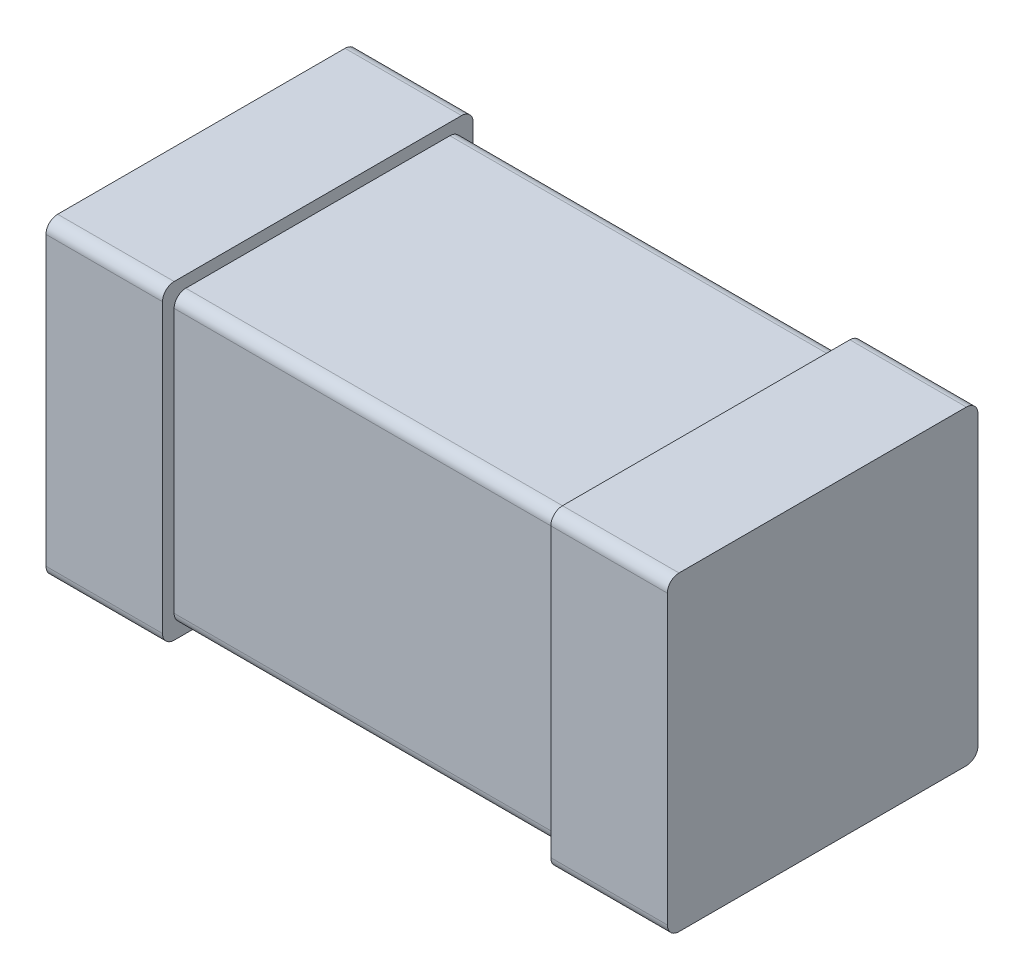
ISO-10303-21;
HEADER;
FILE_DESCRIPTION(('STEP AP214'),'2;1');
FILE_NAME('part.step','',(''),(''),'','','');
FILE_SCHEMA(('AUTOMOTIVE_DESIGN { 1 0 10303 214 1 1 1 1 }'));
ENDSEC;
DATA;
#1=APPLICATION_CONTEXT('core data for automotive mechanical design processes');
#2=APPLICATION_PROTOCOL_DEFINITION('international standard','automotive_design',2000,#1);
#3=PRODUCT_CONTEXT('',#1,'mechanical');
#4=PRODUCT('Part','Part','',(#3));
#5=PRODUCT_RELATED_PRODUCT_CATEGORY('part','',(#4));
#6=PRODUCT_DEFINITION_FORMATION('','',#4);
#7=PRODUCT_DEFINITION_CONTEXT('part definition',#1,'design');
#8=PRODUCT_DEFINITION('design','',#6,#7);
#9=PRODUCT_DEFINITION_SHAPE('','',#8);
#10=(LENGTH_UNIT() NAMED_UNIT(*) SI_UNIT(.MILLI.,.METRE.));
#11=(NAMED_UNIT(*) PLANE_ANGLE_UNIT() SI_UNIT($,.RADIAN.));
#12=(NAMED_UNIT(*) SI_UNIT($,.STERADIAN.) SOLID_ANGLE_UNIT());
#13=UNCERTAINTY_MEASURE_WITH_UNIT(LENGTH_MEASURE(1.E-05),#10,'distance_accuracy_value','');
#14=(GEOMETRIC_REPRESENTATION_CONTEXT(3) GLOBAL_UNCERTAINTY_ASSIGNED_CONTEXT((#13)) GLOBAL_UNIT_ASSIGNED_CONTEXT((#10,
#11,#12)) REPRESENTATION_CONTEXT('',''));
#15=CARTESIAN_POINT('',(0.,0.,0.));
#16=DIRECTION('',(0.,0.,1.));
#17=DIRECTION('',(1.,0.,0.));
#18=AXIS2_PLACEMENT_3D('',#15,#16,#17);
#19=CARTESIAN_POINT('',(-0.8,-0.4,0.));
#20=DIRECTION('',(1.,0.,0.));
#21=DIRECTION('',(0.,0.,1.));
#22=AXIS2_PLACEMENT_3D('',#19,#20,#21);
#23=PLANE('',#22);
#24=CARTESIAN_POINT('',(-0.8,-0.37,0.77));
#25=DIRECTION('',(-1.,0.,0.));
#26=DIRECTION('',(0.,0.,1.));
#27=AXIS2_PLACEMENT_3D('',#24,#25,#26);
#28=CIRCLE('',#27,0.03);
#29=CARTESIAN_POINT('',(-0.8,-0.4,0.77));
#30=VERTEX_POINT('',#29);
#31=CARTESIAN_POINT('',(-0.8,-0.37,0.8));
#32=VERTEX_POINT('',#31);
#33=EDGE_CURVE('E11',#30,#32,#28,.T.);
#34=ORIENTED_EDGE('',*,*,#33,.T.);
#35=DIRECTION('',(0.,1.,0.));
#36=VECTOR('',#35,1.);
#37=CARTESIAN_POINT('',(-0.8,-0.4,0.8));
#38=LINE('',#37,#36);
#39=CARTESIAN_POINT('',(-0.8,0.37,0.8));
#40=VERTEX_POINT('',#39);
#41=EDGE_CURVE('E25',#32,#40,#38,.T.);
#42=ORIENTED_EDGE('',*,*,#41,.T.);
#43=CARTESIAN_POINT('',(-0.8,0.37,0.77));
#44=DIRECTION('',(1.,0.,0.));
#45=DIRECTION('',(0.,0.,1.));
#46=AXIS2_PLACEMENT_3D('',#43,#44,#45);
#47=CIRCLE('',#46,0.03);
#48=CARTESIAN_POINT('',(-0.8,0.4,0.77));
#49=VERTEX_POINT('',#48);
#50=EDGE_CURVE('E450',#49,#40,#47,.T.);
#51=ORIENTED_EDGE('',*,*,#50,.F.);
#52=DIRECTION('',(0.,0.,1.));
#53=VECTOR('',#52,1.);
#54=CARTESIAN_POINT('',(-0.8,0.4,0.));
#55=LINE('',#54,#53);
#56=CARTESIAN_POINT('',(-0.8,0.4,0.03));
#57=VERTEX_POINT('',#56);
#58=EDGE_CURVE('E445',#57,#49,#55,.T.);
#59=ORIENTED_EDGE('',*,*,#58,.F.);
#60=CARTESIAN_POINT('',(-0.8,0.37,0.03));
#61=DIRECTION('',(-1.,0.,0.));
#62=DIRECTION('',(0.,0.,1.));
#63=AXIS2_PLACEMENT_3D('',#60,#61,#62);
#64=CIRCLE('',#63,0.03);
#65=CARTESIAN_POINT('',(-0.8,0.37,0.));
#66=VERTEX_POINT('',#65);
#67=EDGE_CURVE('E441',#57,#66,#64,.T.);
#68=ORIENTED_EDGE('',*,*,#67,.T.);
#69=DIRECTION('',(0.,1.,0.));
#70=VECTOR('',#69,1.);
#71=CARTESIAN_POINT('',(-0.8,-0.4,0.));
#72=LINE('',#71,#70);
#73=CARTESIAN_POINT('',(-0.8,-0.37,0.));
#74=VERTEX_POINT('',#73);
#75=EDGE_CURVE('E436',#74,#66,#72,.T.);
#76=ORIENTED_EDGE('',*,*,#75,.F.);
#77=CARTESIAN_POINT('',(-0.8,-0.37,0.03));
#78=DIRECTION('',(1.,0.,0.));
#79=DIRECTION('',(0.,0.,1.));
#80=AXIS2_PLACEMENT_3D('',#77,#78,#79);
#81=CIRCLE('',#80,0.03);
#82=CARTESIAN_POINT('',(-0.8,-0.4,0.03));
#83=VERTEX_POINT('',#82);
#84=EDGE_CURVE('E431',#83,#74,#81,.T.);
#85=ORIENTED_EDGE('',*,*,#84,.F.);
#86=DIRECTION('',(0.,0.,1.));
#87=VECTOR('',#86,1.);
#88=CARTESIAN_POINT('',(-0.8,-0.4,0.));
#89=LINE('',#88,#87);
#90=EDGE_CURVE('E427',#83,#30,#89,.T.);
#91=ORIENTED_EDGE('',*,*,#90,.T.);
#92=EDGE_LOOP('',(#34,#42,#51,#59,#68,#76,#85,#91));
#93=FACE_BOUND('',#92,.T.);
#94=ADVANCED_FACE('F17',(#93),#23,.F.);
#95=CARTESIAN_POINT('',(-0.8,-0.4,0.));
#96=DIRECTION('',(0.,1.,0.));
#97=DIRECTION('',(0.,0.,1.));
#98=AXIS2_PLACEMENT_3D('',#95,#96,#97);
#99=PLANE('',#98);
#100=DIRECTION('',(1.,0.,0.));
#101=VECTOR('',#100,1.);
#102=CARTESIAN_POINT('',(-0.8,-0.4,0.77));
#103=LINE('',#102,#101);
#104=CARTESIAN_POINT('',(-0.5,-0.4,0.77));
#105=VERTEX_POINT('',#104);
#106=EDGE_CURVE('E422',#30,#105,#103,.T.);
#107=ORIENTED_EDGE('',*,*,#106,.F.);
#108=ORIENTED_EDGE('',*,*,#90,.F.);
#109=DIRECTION('',(1.,0.,0.));
#110=VECTOR('',#109,1.);
#111=CARTESIAN_POINT('',(-0.8,-0.4,0.03));
#112=LINE('',#111,#110);
#113=CARTESIAN_POINT('',(-0.5,-0.4,0.03));
#114=VERTEX_POINT('',#113);
#115=EDGE_CURVE('E418',#83,#114,#112,.T.);
#116=ORIENTED_EDGE('',*,*,#115,.T.);
#117=DIRECTION('',(0.,0.,1.));
#118=VECTOR('',#117,1.);
#119=CARTESIAN_POINT('',(-0.5,-0.4,0.));
#120=LINE('',#119,#118);
#121=EDGE_CURVE('E414',#114,#105,#120,.T.);
#122=ORIENTED_EDGE('',*,*,#121,.T.);
#123=EDGE_LOOP('',(#107,#108,#116,#122));
#124=FACE_BOUND('',#123,.T.);
#125=ADVANCED_FACE('F495',(#124),#99,.F.);
#126=CARTESIAN_POINT('',(-0.5,-0.4,0.));
#127=DIRECTION('',(1.,0.,0.));
#128=DIRECTION('',(0.,0.,1.));
#129=AXIS2_PLACEMENT_3D('',#126,#127,#128);
#130=PLANE('',#129);
#131=ORIENTED_EDGE('',*,*,#121,.F.);
#132=CARTESIAN_POINT('',(-0.5,-0.37,0.03));
#133=DIRECTION('',(1.,0.,0.));
#134=DIRECTION('',(0.,0.,1.));
#135=AXIS2_PLACEMENT_3D('',#132,#133,#134);
#136=CIRCLE('',#135,0.03);
#137=CARTESIAN_POINT('',(-0.5,-0.37,0.));
#138=VERTEX_POINT('',#137);
#139=EDGE_CURVE('E410',#114,#138,#136,.T.);
#140=ORIENTED_EDGE('',*,*,#139,.T.);
#141=DIRECTION('',(0.,1.,0.));
#142=VECTOR('',#141,1.);
#143=CARTESIAN_POINT('',(-0.5,-0.4,0.));
#144=LINE('',#143,#142);
#145=CARTESIAN_POINT('',(-0.5,0.37,0.));
#146=VERTEX_POINT('',#145);
#147=EDGE_CURVE('E406',#138,#146,#144,.T.);
#148=ORIENTED_EDGE('',*,*,#147,.T.);
#149=CARTESIAN_POINT('',(-0.5,0.37,0.03));
#150=DIRECTION('',(-1.,0.,0.));
#151=DIRECTION('',(0.,0.,1.));
#152=AXIS2_PLACEMENT_3D('',#149,#150,#151);
#153=CIRCLE('',#152,0.03);
#154=CARTESIAN_POINT('',(-0.5,0.4,0.03));
#155=VERTEX_POINT('',#154);
#156=EDGE_CURVE('E401',#155,#146,#153,.T.);
#157=ORIENTED_EDGE('',*,*,#156,.F.);
#158=DIRECTION('',(0.,0.,1.));
#159=VECTOR('',#158,1.);
#160=CARTESIAN_POINT('',(-0.5,0.4,0.));
#161=LINE('',#160,#159);
#162=CARTESIAN_POINT('',(-0.5,0.4,0.77));
#163=VERTEX_POINT('',#162);
#164=EDGE_CURVE('E397',#155,#163,#161,.T.);
#165=ORIENTED_EDGE('',*,*,#164,.T.);
#166=CARTESIAN_POINT('',(-0.5,0.37,0.77));
#167=DIRECTION('',(1.,0.,0.));
#168=DIRECTION('',(0.,0.,1.));
#169=AXIS2_PLACEMENT_3D('',#166,#167,#168);
#170=CIRCLE('',#169,0.03);
#171=CARTESIAN_POINT('',(-0.5,0.37,0.8));
#172=VERTEX_POINT('',#171);
#173=EDGE_CURVE('E393',#163,#172,#170,.T.);
#174=ORIENTED_EDGE('',*,*,#173,.T.);
#175=DIRECTION('',(0.,1.,0.));
#176=VECTOR('',#175,1.);
#177=CARTESIAN_POINT('',(-0.5,-0.4,0.8));
#178=LINE('',#177,#176);
#179=CARTESIAN_POINT('',(-0.5,-0.37,0.8));
#180=VERTEX_POINT('',#179);
#181=EDGE_CURVE('E388',#180,#172,#178,.T.);
#182=ORIENTED_EDGE('',*,*,#181,.F.);
#183=CARTESIAN_POINT('',(-0.5,-0.37,0.77));
#184=DIRECTION('',(-1.,0.,0.));
#185=DIRECTION('',(0.,0.,1.));
#186=AXIS2_PLACEMENT_3D('',#183,#184,#185);
#187=CIRCLE('',#186,0.03);
#188=EDGE_CURVE('E383',#105,#180,#187,.T.);
#189=ORIENTED_EDGE('',*,*,#188,.F.);
#190=EDGE_LOOP('',(#131,#140,#148,#157,#165,#174,#182,#189));
#191=FACE_BOUND('',#190,.T.);
#192=CARTESIAN_POINT('',(-0.5,-0.34,0.06));
#193=DIRECTION('',(1.,0.,0.));
#194=DIRECTION('',(0.,0.,1.));
#195=AXIS2_PLACEMENT_3D('',#192,#193,#194);
#196=CIRCLE('',#195,0.03);
#197=CARTESIAN_POINT('',(-0.5,-0.37,0.06));
#198=VERTEX_POINT('',#197);
#199=CARTESIAN_POINT('',(-0.5,-0.34,0.03));
#200=VERTEX_POINT('',#199);
#201=EDGE_CURVE('E378',#198,#200,#196,.T.);
#202=ORIENTED_EDGE('',*,*,#201,.F.);
#203=DIRECTION('',(0.,0.,1.));
#204=VECTOR('',#203,1.);
#205=CARTESIAN_POINT('',(-0.5,-0.37,0.03));
#206=LINE('',#205,#204);
#207=CARTESIAN_POINT('',(-0.5,-0.37,0.74));
#208=VERTEX_POINT('',#207);
#209=EDGE_CURVE('E374',#198,#208,#206,.T.);
#210=ORIENTED_EDGE('',*,*,#209,.T.);
#211=CARTESIAN_POINT('',(-0.5,-0.34,0.74));
#212=DIRECTION('',(-1.,0.,0.));
#213=DIRECTION('',(0.,0.,1.));
#214=AXIS2_PLACEMENT_3D('',#211,#212,#213);
#215=CIRCLE('',#214,0.03);
#216=CARTESIAN_POINT('',(-0.5,-0.34,0.77));
#217=VERTEX_POINT('',#216);
#218=EDGE_CURVE('E370',#208,#217,#215,.T.);
#219=ORIENTED_EDGE('',*,*,#218,.T.);
#220=DIRECTION('',(0.,1.,0.));
#221=VECTOR('',#220,1.);
#222=CARTESIAN_POINT('',(-0.5,-0.37,0.77));
#223=LINE('',#222,#221);
#224=CARTESIAN_POINT('',(-0.5,0.34,0.77));
#225=VERTEX_POINT('',#224);
#226=EDGE_CURVE('E366',#217,#225,#223,.T.);
#227=ORIENTED_EDGE('',*,*,#226,.T.);
#228=CARTESIAN_POINT('',(-0.5,0.34,0.74));
#229=DIRECTION('',(1.,0.,0.));
#230=DIRECTION('',(0.,0.,1.));
#231=AXIS2_PLACEMENT_3D('',#228,#229,#230);
#232=CIRCLE('',#231,0.03);
#233=CARTESIAN_POINT('',(-0.5,0.37,0.74));
#234=VERTEX_POINT('',#233);
#235=EDGE_CURVE('E361',#234,#225,#232,.T.);
#236=ORIENTED_EDGE('',*,*,#235,.F.);
#237=DIRECTION('',(0.,0.,1.));
#238=VECTOR('',#237,1.);
#239=CARTESIAN_POINT('',(-0.5,0.37,0.03));
#240=LINE('',#239,#238);
#241=CARTESIAN_POINT('',(-0.5,0.37,0.06));
#242=VERTEX_POINT('',#241);
#243=EDGE_CURVE('E356',#242,#234,#240,.T.);
#244=ORIENTED_EDGE('',*,*,#243,.F.);
#245=CARTESIAN_POINT('',(-0.5,0.34,0.06));
#246=DIRECTION('',(-1.,0.,0.));
#247=DIRECTION('',(0.,0.,1.));
#248=AXIS2_PLACEMENT_3D('',#245,#246,#247);
#249=CIRCLE('',#248,0.03);
#250=CARTESIAN_POINT('',(-0.5,0.34,0.03));
#251=VERTEX_POINT('',#250);
#252=EDGE_CURVE('E352',#242,#251,#249,.T.);
#253=ORIENTED_EDGE('',*,*,#252,.T.);
#254=DIRECTION('',(0.,1.,0.));
#255=VECTOR('',#254,1.);
#256=CARTESIAN_POINT('',(-0.5,-0.37,0.03));
#257=LINE('',#256,#255);
#258=EDGE_CURVE('E347',#200,#251,#257,.T.);
#259=ORIENTED_EDGE('',*,*,#258,.F.);
#260=EDGE_LOOP('',(#202,#210,#219,#227,#236,#244,#253,#259));
#261=FACE_BOUND('',#260,.T.);
#262=ADVANCED_FACE('F573',(#191,#261),#130,.T.);
#263=CARTESIAN_POINT('',(-0.5,-0.37,0.03));
#264=DIRECTION('',(0.,0.,1.));
#265=DIRECTION('',(1.,0.,0.));
#266=AXIS2_PLACEMENT_3D('',#263,#264,#265);
#267=PLANE('',#266);
#268=DIRECTION('',(1.,0.,0.));
#269=VECTOR('',#268,1.);
#270=CARTESIAN_POINT('',(-0.5,0.34,0.03));
#271=LINE('',#270,#269);
#272=CARTESIAN_POINT('',(0.5,0.34,0.03));
#273=VERTEX_POINT('',#272);
#274=EDGE_CURVE('E343',#251,#273,#271,.T.);
#275=ORIENTED_EDGE('',*,*,#274,.T.);
#276=DIRECTION('',(0.,1.,0.));
#277=VECTOR('',#276,1.);
#278=CARTESIAN_POINT('',(0.5,-0.37,0.03));
#279=LINE('',#278,#277);
#280=CARTESIAN_POINT('',(0.5,-0.34,0.03));
#281=VERTEX_POINT('',#280);
#282=EDGE_CURVE('E338',#281,#273,#279,.T.);
#283=ORIENTED_EDGE('',*,*,#282,.F.);
#284=DIRECTION('',(1.,0.,0.));
#285=VECTOR('',#284,1.);
#286=CARTESIAN_POINT('',(-0.5,-0.34,0.03));
#287=LINE('',#286,#285);
#288=EDGE_CURVE('E333',#200,#281,#287,.T.);
#289=ORIENTED_EDGE('',*,*,#288,.F.);
#290=ORIENTED_EDGE('',*,*,#258,.T.);
#291=EDGE_LOOP('',(#275,#283,#289,#290));
#292=FACE_BOUND('',#291,.T.);
#293=ADVANCED_FACE('F577',(#292),#267,.F.);
#294=CARTESIAN_POINT('',(-0.5,-0.34,0.06));
#295=DIRECTION('',(1.,0.,0.));
#296=DIRECTION('',(0.,0.707106781186547,0.707106781186548));
#297=AXIS2_PLACEMENT_3D('',#294,#295,#296);
#298=CYLINDRICAL_SURFACE('',#297,0.03);
#299=ORIENTED_EDGE('',*,*,#201,.T.);
#300=ORIENTED_EDGE('',*,*,#288,.T.);
#301=CARTESIAN_POINT('',(0.5,-0.34,0.06));
#302=DIRECTION('',(1.,0.,0.));
#303=DIRECTION('',(0.,0.,1.));
#304=AXIS2_PLACEMENT_3D('',#301,#302,#303);
#305=CIRCLE('',#304,0.03);
#306=CARTESIAN_POINT('',(0.5,-0.37,0.06));
#307=VERTEX_POINT('',#306);
#308=EDGE_CURVE('E328',#307,#281,#305,.T.);
#309=ORIENTED_EDGE('',*,*,#308,.F.);
#310=DIRECTION('',(1.,0.,0.));
#311=VECTOR('',#310,1.);
#312=CARTESIAN_POINT('',(-0.5,-0.37,0.06));
#313=LINE('',#312,#311);
#314=EDGE_CURVE('E323',#198,#307,#313,.T.);
#315=ORIENTED_EDGE('',*,*,#314,.F.);
#316=EDGE_LOOP('',(#299,#300,#309,#315));
#317=FACE_BOUND('',#316,.T.);
#318=ADVANCED_FACE('F583',(#317),#298,.T.);
#319=CARTESIAN_POINT('',(-0.5,-0.37,0.03));
#320=DIRECTION('',(0.,1.,0.));
#321=DIRECTION('',(0.,0.,1.));
#322=AXIS2_PLACEMENT_3D('',#319,#320,#321);
#323=PLANE('',#322);
#324=DIRECTION('',(1.,0.,0.));
#325=VECTOR('',#324,1.);
#326=CARTESIAN_POINT('',(-0.5,-0.37,0.74));
#327=LINE('',#326,#325);
#328=CARTESIAN_POINT('',(0.5,-0.37,0.74));
#329=VERTEX_POINT('',#328);
#330=EDGE_CURVE('E318',#208,#329,#327,.T.);
#331=ORIENTED_EDGE('',*,*,#330,.F.);
#332=ORIENTED_EDGE('',*,*,#209,.F.);
#333=ORIENTED_EDGE('',*,*,#314,.T.);
#334=DIRECTION('',(0.,0.,1.));
#335=VECTOR('',#334,1.);
#336=CARTESIAN_POINT('',(0.5,-0.37,0.03));
#337=LINE('',#336,#335);
#338=EDGE_CURVE('E314',#307,#329,#337,.T.);
#339=ORIENTED_EDGE('',*,*,#338,.T.);
#340=EDGE_LOOP('',(#331,#332,#333,#339));
#341=FACE_BOUND('',#340,.T.);
#342=ADVANCED_FACE('F587',(#341),#323,.F.);
#343=CARTESIAN_POINT('',(0.5,-0.4,0.));
#344=DIRECTION('',(1.,0.,0.));
#345=DIRECTION('',(0.,0.,1.));
#346=AXIS2_PLACEMENT_3D('',#343,#344,#345);
#347=PLANE('',#346);
#348=CARTESIAN_POINT('',(0.5,-0.37,0.77));
#349=DIRECTION('',(-1.,0.,0.));
#350=DIRECTION('',(0.,0.,1.));
#351=AXIS2_PLACEMENT_3D('',#348,#349,#350);
#352=CIRCLE('',#351,0.03);
#353=CARTESIAN_POINT('',(0.5,-0.4,0.77));
#354=VERTEX_POINT('',#353);
#355=CARTESIAN_POINT('',(0.5,-0.37,0.8));
#356=VERTEX_POINT('',#355);
#357=EDGE_CURVE('E310',#354,#356,#352,.T.);
#358=ORIENTED_EDGE('',*,*,#357,.T.);
#359=DIRECTION('',(0.,1.,0.));
#360=VECTOR('',#359,1.);
#361=CARTESIAN_POINT('',(0.5,-0.4,0.8));
#362=LINE('',#361,#360);
#363=CARTESIAN_POINT('',(0.5,0.37,0.8));
#364=VERTEX_POINT('',#363);
#365=EDGE_CURVE('E191',#356,#364,#362,.T.);
#366=ORIENTED_EDGE('',*,*,#365,.T.);
#367=CARTESIAN_POINT('',(0.5,0.37,0.77));
#368=DIRECTION('',(1.,0.,0.));
#369=DIRECTION('',(0.,0.,1.));
#370=AXIS2_PLACEMENT_3D('',#367,#368,#369);
#371=CIRCLE('',#370,0.03);
#372=CARTESIAN_POINT('',(0.5,0.4,0.77));
#373=VERTEX_POINT('',#372);
#374=EDGE_CURVE('E302',#373,#364,#371,.T.);
#375=ORIENTED_EDGE('',*,*,#374,.F.);
#376=DIRECTION('',(0.,0.,1.));
#377=VECTOR('',#376,1.);
#378=CARTESIAN_POINT('',(0.5,0.4,0.));
#379=LINE('',#378,#377);
#380=CARTESIAN_POINT('',(0.5,0.4,0.03));
#381=VERTEX_POINT('',#380);
#382=EDGE_CURVE('E297',#381,#373,#379,.T.);
#383=ORIENTED_EDGE('',*,*,#382,.F.);
#384=CARTESIAN_POINT('',(0.5,0.37,0.03));
#385=DIRECTION('',(-1.,0.,0.));
#386=DIRECTION('',(0.,0.,1.));
#387=AXIS2_PLACEMENT_3D('',#384,#385,#386);
#388=CIRCLE('',#387,0.03);
#389=CARTESIAN_POINT('',(0.5,0.37,0.));
#390=VERTEX_POINT('',#389);
#391=EDGE_CURVE('E293',#381,#390,#388,.T.);
#392=ORIENTED_EDGE('',*,*,#391,.T.);
#393=DIRECTION('',(0.,1.,0.));
#394=VECTOR('',#393,1.);
#395=CARTESIAN_POINT('',(0.5,-0.4,0.));
#396=LINE('',#395,#394);
#397=CARTESIAN_POINT('',(0.5,-0.37,0.));
#398=VERTEX_POINT('',#397);
#399=EDGE_CURVE('E288',#398,#390,#396,.T.);
#400=ORIENTED_EDGE('',*,*,#399,.F.);
#401=CARTESIAN_POINT('',(0.5,-0.37,0.03));
#402=DIRECTION('',(1.,0.,0.));
#403=DIRECTION('',(0.,0.,1.));
#404=AXIS2_PLACEMENT_3D('',#401,#402,#403);
#405=CIRCLE('',#404,0.03);
#406=CARTESIAN_POINT('',(0.5,-0.4,0.03));
#407=VERTEX_POINT('',#406);
#408=EDGE_CURVE('E283',#407,#398,#405,.T.);
#409=ORIENTED_EDGE('',*,*,#408,.F.);
#410=DIRECTION('',(0.,0.,1.));
#411=VECTOR('',#410,1.);
#412=CARTESIAN_POINT('',(0.5,-0.4,0.));
#413=LINE('',#412,#411);
#414=EDGE_CURVE('E279',#407,#354,#413,.T.);
#415=ORIENTED_EDGE('',*,*,#414,.T.);
#416=EDGE_LOOP('',(#358,#366,#375,#383,#392,#400,#409,#415));
#417=FACE_BOUND('',#416,.T.);
#418=ORIENTED_EDGE('',*,*,#282,.T.);
#419=CARTESIAN_POINT('',(0.5,0.34,0.06));
#420=DIRECTION('',(-1.,0.,0.));
#421=DIRECTION('',(0.,0.,1.));
#422=AXIS2_PLACEMENT_3D('',#419,#420,#421);
#423=CIRCLE('',#422,0.03);
#424=CARTESIAN_POINT('',(0.5,0.37,0.06));
#425=VERTEX_POINT('',#424);
#426=EDGE_CURVE('E274',#425,#273,#423,.T.);
#427=ORIENTED_EDGE('',*,*,#426,.F.);
#428=DIRECTION('',(0.,0.,1.));
#429=VECTOR('',#428,1.);
#430=CARTESIAN_POINT('',(0.5,0.37,0.03));
#431=LINE('',#430,#429);
#432=CARTESIAN_POINT('',(0.5,0.37,0.74));
#433=VERTEX_POINT('',#432);
#434=EDGE_CURVE('E270',#425,#433,#431,.T.);
#435=ORIENTED_EDGE('',*,*,#434,.T.);
#436=CARTESIAN_POINT('',(0.5,0.34,0.74));
#437=DIRECTION('',(1.,0.,0.));
#438=DIRECTION('',(0.,0.,1.));
#439=AXIS2_PLACEMENT_3D('',#436,#437,#438);
#440=CIRCLE('',#439,0.03);
#441=CARTESIAN_POINT('',(0.5,0.34,0.77));
#442=VERTEX_POINT('',#441);
#443=EDGE_CURVE('E266',#433,#442,#440,.T.);
#444=ORIENTED_EDGE('',*,*,#443,.T.);
#445=DIRECTION('',(0.,1.,0.));
#446=VECTOR('',#445,1.);
#447=CARTESIAN_POINT('',(0.5,-0.37,0.77));
#448=LINE('',#447,#446);
#449=CARTESIAN_POINT('',(0.5,-0.34,0.77));
#450=VERTEX_POINT('',#449);
#451=EDGE_CURVE('E261',#450,#442,#448,.T.);
#452=ORIENTED_EDGE('',*,*,#451,.F.);
#453=CARTESIAN_POINT('',(0.5,-0.34,0.74));
#454=DIRECTION('',(-1.,0.,0.));
#455=DIRECTION('',(0.,0.,1.));
#456=AXIS2_PLACEMENT_3D('',#453,#454,#455);
#457=CIRCLE('',#456,0.03);
#458=EDGE_CURVE('E256',#329,#450,#457,.T.);
#459=ORIENTED_EDGE('',*,*,#458,.F.);
#460=ORIENTED_EDGE('',*,*,#338,.F.);
#461=ORIENTED_EDGE('',*,*,#308,.T.);
#462=EDGE_LOOP('',(#418,#427,#435,#444,#452,#459,#460,#461));
#463=FACE_BOUND('',#462,.T.);
#464=ADVANCED_FACE('F539',(#417,#463),#347,.F.);
#465=CARTESIAN_POINT('',(-0.5,-0.34,0.74));
#466=DIRECTION('',(1.,0.,0.));
#467=DIRECTION('',(0.,0.707106781186547,-0.707106781186548));
#468=AXIS2_PLACEMENT_3D('',#465,#466,#467);
#469=CYLINDRICAL_SURFACE('',#468,0.03);
#470=ORIENTED_EDGE('',*,*,#330,.T.);
#471=ORIENTED_EDGE('',*,*,#458,.T.);
#472=DIRECTION('',(1.,0.,0.));
#473=VECTOR('',#472,1.);
#474=CARTESIAN_POINT('',(-0.5,-0.34,0.77));
#475=LINE('',#474,#473);
#476=EDGE_CURVE('E251',#217,#450,#475,.T.);
#477=ORIENTED_EDGE('',*,*,#476,.F.);
#478=ORIENTED_EDGE('',*,*,#218,.F.);
#479=EDGE_LOOP('',(#470,#471,#477,#478));
#480=FACE_BOUND('',#479,.T.);
#481=ADVANCED_FACE('F594',(#480),#469,.T.);
#482=CARTESIAN_POINT('',(-0.5,-0.37,0.77));
#483=DIRECTION('',(0.,0.,1.));
#484=DIRECTION('',(1.,0.,0.));
#485=AXIS2_PLACEMENT_3D('',#482,#483,#484);
#486=PLANE('',#485);
#487=ORIENTED_EDGE('',*,*,#226,.F.);
#488=ORIENTED_EDGE('',*,*,#476,.T.);
#489=ORIENTED_EDGE('',*,*,#451,.T.);
#490=DIRECTION('',(1.,0.,0.));
#491=VECTOR('',#490,1.);
#492=CARTESIAN_POINT('',(-0.5,0.34,0.77));
#493=LINE('',#492,#491);
#494=EDGE_CURVE('E246',#225,#442,#493,.T.);
#495=ORIENTED_EDGE('',*,*,#494,.F.);
#496=EDGE_LOOP('',(#487,#488,#489,#495));
#497=FACE_BOUND('',#496,.T.);
#498=ADVANCED_FACE('F597',(#497),#486,.T.);
#499=CARTESIAN_POINT('',(-0.5,0.34,0.74));
#500=DIRECTION('',(1.,0.,0.));
#501=DIRECTION('',(0.,-0.707106781186547,-0.707106781186548));
#502=AXIS2_PLACEMENT_3D('',#499,#500,#501);
#503=CYLINDRICAL_SURFACE('',#502,0.03);
#504=ORIENTED_EDGE('',*,*,#235,.T.);
#505=ORIENTED_EDGE('',*,*,#494,.T.);
#506=ORIENTED_EDGE('',*,*,#443,.F.);
#507=DIRECTION('',(1.,0.,0.));
#508=VECTOR('',#507,1.);
#509=CARTESIAN_POINT('',(-0.5,0.37,0.74));
#510=LINE('',#509,#508);
#511=EDGE_CURVE('E241',#234,#433,#510,.T.);
#512=ORIENTED_EDGE('',*,*,#511,.F.);
#513=EDGE_LOOP('',(#504,#505,#506,#512));
#514=FACE_BOUND('',#513,.T.);
#515=ADVANCED_FACE('F601',(#514),#503,.T.);
#516=CARTESIAN_POINT('',(-0.5,0.37,0.03));
#517=DIRECTION('',(0.,1.,0.));
#518=DIRECTION('',(0.,0.,1.));
#519=AXIS2_PLACEMENT_3D('',#516,#517,#518);
#520=PLANE('',#519);
#521=ORIENTED_EDGE('',*,*,#434,.F.);
#522=DIRECTION('',(1.,0.,0.));
#523=VECTOR('',#522,1.);
#524=CARTESIAN_POINT('',(-0.5,0.37,0.06));
#525=LINE('',#524,#523);
#526=EDGE_CURVE('E236',#242,#425,#525,.T.);
#527=ORIENTED_EDGE('',*,*,#526,.F.);
#528=ORIENTED_EDGE('',*,*,#243,.T.);
#529=ORIENTED_EDGE('',*,*,#511,.T.);
#530=EDGE_LOOP('',(#521,#527,#528,#529));
#531=FACE_BOUND('',#530,.T.);
#532=ADVANCED_FACE('F605',(#531),#520,.T.);
#533=CARTESIAN_POINT('',(-0.5,0.34,0.06));
#534=DIRECTION('',(1.,0.,0.));
#535=DIRECTION('',(0.,-0.707106781186547,0.707106781186548));
#536=AXIS2_PLACEMENT_3D('',#533,#534,#535);
#537=CYLINDRICAL_SURFACE('',#536,0.03);
#538=ORIENTED_EDGE('',*,*,#526,.T.);
#539=ORIENTED_EDGE('',*,*,#426,.T.);
#540=ORIENTED_EDGE('',*,*,#274,.F.);
#541=ORIENTED_EDGE('',*,*,#252,.F.);
#542=EDGE_LOOP('',(#538,#539,#540,#541));
#543=FACE_BOUND('',#542,.T.);
#544=ADVANCED_FACE('F609',(#543),#537,.T.);
#545=CARTESIAN_POINT('',(0.5,-0.4,0.));
#546=DIRECTION('',(0.,1.,0.));
#547=DIRECTION('',(0.,0.,1.));
#548=AXIS2_PLACEMENT_3D('',#545,#546,#547);
#549=PLANE('',#548);
#550=DIRECTION('',(1.,0.,0.));
#551=VECTOR('',#550,1.);
#552=CARTESIAN_POINT('',(0.5,-0.4,0.77));
#553=LINE('',#552,#551);
#554=CARTESIAN_POINT('',(0.8,-0.4,0.77));
#555=VERTEX_POINT('',#554);
#556=EDGE_CURVE('E198',#354,#555,#553,.T.);
#557=ORIENTED_EDGE('',*,*,#556,.F.);
#558=ORIENTED_EDGE('',*,*,#414,.F.);
#559=DIRECTION('',(1.,0.,0.));
#560=VECTOR('',#559,1.);
#561=CARTESIAN_POINT('',(0.5,-0.4,0.03));
#562=LINE('',#561,#560);
#563=CARTESIAN_POINT('',(0.8,-0.4,0.03));
#564=VERTEX_POINT('',#563);
#565=EDGE_CURVE('E229',#407,#564,#562,.T.);
#566=ORIENTED_EDGE('',*,*,#565,.T.);
#567=DIRECTION('',(0.,0.,1.));
#568=VECTOR('',#567,1.);
#569=CARTESIAN_POINT('',(0.8,-0.4,0.));
#570=LINE('',#569,#568);
#571=EDGE_CURVE('E225',#564,#555,#570,.T.);
#572=ORIENTED_EDGE('',*,*,#571,.T.);
#573=EDGE_LOOP('',(#557,#558,#566,#572));
#574=FACE_BOUND('',#573,.T.);
#575=ADVANCED_FACE('F545',(#574),#549,.F.);
#576=CARTESIAN_POINT('',(0.8,-0.4,0.));
#577=DIRECTION('',(1.,0.,0.));
#578=DIRECTION('',(0.,0.,1.));
#579=AXIS2_PLACEMENT_3D('',#576,#577,#578);
#580=PLANE('',#579);
#581=ORIENTED_EDGE('',*,*,#571,.F.);
#582=CARTESIAN_POINT('',(0.8,-0.37,0.03));
#583=DIRECTION('',(1.,0.,0.));
#584=DIRECTION('',(0.,0.,1.));
#585=AXIS2_PLACEMENT_3D('',#582,#583,#584);
#586=CIRCLE('',#585,0.03);
#587=CARTESIAN_POINT('',(0.8,-0.37,0.));
#588=VERTEX_POINT('',#587);
#589=EDGE_CURVE('E221',#564,#588,#586,.T.);
#590=ORIENTED_EDGE('',*,*,#589,.T.);
#591=DIRECTION('',(0.,1.,0.));
#592=VECTOR('',#591,1.);
#593=CARTESIAN_POINT('',(0.8,-0.4,0.));
#594=LINE('',#593,#592);
#595=CARTESIAN_POINT('',(0.8,0.37,0.));
#596=VERTEX_POINT('',#595);
#597=EDGE_CURVE('E217',#588,#596,#594,.T.);
#598=ORIENTED_EDGE('',*,*,#597,.T.);
#599=CARTESIAN_POINT('',(0.8,0.37,0.03));
#600=DIRECTION('',(-1.,0.,0.));
#601=DIRECTION('',(0.,0.,1.));
#602=AXIS2_PLACEMENT_3D('',#599,#600,#601);
#603=CIRCLE('',#602,0.03);
#604=CARTESIAN_POINT('',(0.8,0.4,0.03));
#605=VERTEX_POINT('',#604);
#606=EDGE_CURVE('E212',#605,#596,#603,.T.);
#607=ORIENTED_EDGE('',*,*,#606,.F.);
#608=DIRECTION('',(0.,0.,1.));
#609=VECTOR('',#608,1.);
#610=CARTESIAN_POINT('',(0.8,0.4,0.));
#611=LINE('',#610,#609);
#612=CARTESIAN_POINT('',(0.8,0.4,0.77));
#613=VERTEX_POINT('',#612);
#614=EDGE_CURVE('E208',#605,#613,#611,.T.);
#615=ORIENTED_EDGE('',*,*,#614,.T.);
#616=CARTESIAN_POINT('',(0.8,0.37,0.77));
#617=DIRECTION('',(1.,0.,0.));
#618=DIRECTION('',(0.,0.,1.));
#619=AXIS2_PLACEMENT_3D('',#616,#617,#618);
#620=CIRCLE('',#619,0.03);
#621=CARTESIAN_POINT('',(0.8,0.37,0.8));
#622=VERTEX_POINT('',#621);
#623=EDGE_CURVE('E182',#613,#622,#620,.T.);
#624=ORIENTED_EDGE('',*,*,#623,.T.);
#625=DIRECTION('',(0.,1.,0.));
#626=VECTOR('',#625,1.);
#627=CARTESIAN_POINT('',(0.8,-0.4,0.8));
#628=LINE('',#627,#626);
#629=CARTESIAN_POINT('',(0.8,-0.37,0.8));
#630=VERTEX_POINT('',#629);
#631=EDGE_CURVE('E174',#630,#622,#628,.T.);
#632=ORIENTED_EDGE('',*,*,#631,.F.);
#633=CARTESIAN_POINT('',(0.8,-0.37,0.77));
#634=DIRECTION('',(-1.,0.,0.));
#635=DIRECTION('',(0.,0.,1.));
#636=AXIS2_PLACEMENT_3D('',#633,#634,#635);
#637=CIRCLE('',#636,0.03);
#638=EDGE_CURVE('E179',#555,#630,#637,.T.);
#639=ORIENTED_EDGE('',*,*,#638,.F.);
#640=EDGE_LOOP('',(#581,#590,#598,#607,#615,#624,#632,#639));
#641=FACE_BOUND('',#640,.T.);
#642=ADVANCED_FACE('F177',(#641),#580,.T.);
#643=CARTESIAN_POINT('',(0.5,-0.37,0.77));
#644=DIRECTION('',(1.,0.,0.));
#645=DIRECTION('',(0.,0.707106781186547,-0.707106781186548));
#646=AXIS2_PLACEMENT_3D('',#643,#644,#645);
#647=CYLINDRICAL_SURFACE('',#646,0.03);
#648=ORIENTED_EDGE('',*,*,#556,.T.);
#649=ORIENTED_EDGE('',*,*,#638,.T.);
#650=DIRECTION('',(1.,0.,0.));
#651=VECTOR('',#650,1.);
#652=CARTESIAN_POINT('',(0.5,-0.37,0.8));
#653=LINE('',#652,#651);
#654=EDGE_CURVE('E189',#356,#630,#653,.T.);
#655=ORIENTED_EDGE('',*,*,#654,.F.);
#656=ORIENTED_EDGE('',*,*,#357,.F.);
#657=EDGE_LOOP('',(#648,#649,#655,#656));
#658=FACE_BOUND('',#657,.T.);
#659=ADVANCED_FACE('F196',(#658),#647,.T.);
#660=CARTESIAN_POINT('',(0.5,-0.4,0.8));
#661=DIRECTION('',(0.,0.,1.));
#662=DIRECTION('',(1.,0.,0.));
#663=AXIS2_PLACEMENT_3D('',#660,#661,#662);
#664=PLANE('',#663);
#665=ORIENTED_EDGE('',*,*,#365,.F.);
#666=ORIENTED_EDGE('',*,*,#654,.T.);
#667=ORIENTED_EDGE('',*,*,#631,.T.);
#668=DIRECTION('',(1.,0.,0.));
#669=VECTOR('',#668,1.);
#670=CARTESIAN_POINT('',(0.5,0.37,0.8));
#671=LINE('',#670,#669);
#672=EDGE_CURVE('E194',#364,#622,#671,.T.);
#673=ORIENTED_EDGE('',*,*,#672,.F.);
#674=EDGE_LOOP('',(#665,#666,#667,#673));
#675=FACE_BOUND('',#674,.T.);
#676=ADVANCED_FACE('F190',(#675),#664,.T.);
#677=CARTESIAN_POINT('',(0.5,0.37,0.77));
#678=DIRECTION('',(1.,0.,0.));
#679=DIRECTION('',(0.,-0.707106781186547,-0.707106781186548));
#680=AXIS2_PLACEMENT_3D('',#677,#678,#679);
#681=CYLINDRICAL_SURFACE('',#680,0.03);
#682=ORIENTED_EDGE('',*,*,#374,.T.);
#683=ORIENTED_EDGE('',*,*,#672,.T.);
#684=ORIENTED_EDGE('',*,*,#623,.F.);
#685=DIRECTION('',(1.,0.,0.));
#686=VECTOR('',#685,1.);
#687=CARTESIAN_POINT('',(0.5,0.4,0.77));
#688=LINE('',#687,#686);
#689=EDGE_CURVE('E526',#373,#613,#688,.T.);
#690=ORIENTED_EDGE('',*,*,#689,.F.);
#691=EDGE_LOOP('',(#682,#683,#684,#690));
#692=FACE_BOUND('',#691,.T.);
#693=ADVANCED_FACE('F536',(#692),#681,.T.);
#694=CARTESIAN_POINT('',(0.5,0.4,0.));
#695=DIRECTION('',(0.,1.,0.));
#696=DIRECTION('',(0.,0.,1.));
#697=AXIS2_PLACEMENT_3D('',#694,#695,#696);
#698=PLANE('',#697);
#699=ORIENTED_EDGE('',*,*,#614,.F.);
#700=DIRECTION('',(1.,0.,0.));
#701=VECTOR('',#700,1.);
#702=CARTESIAN_POINT('',(0.5,0.4,0.03));
#703=LINE('',#702,#701);
#704=EDGE_CURVE('E521',#381,#605,#703,.T.);
#705=ORIENTED_EDGE('',*,*,#704,.F.);
#706=ORIENTED_EDGE('',*,*,#382,.T.);
#707=ORIENTED_EDGE('',*,*,#689,.T.);
#708=EDGE_LOOP('',(#699,#705,#706,#707));
#709=FACE_BOUND('',#708,.T.);
#710=ADVANCED_FACE('F559',(#709),#698,.T.);
#711=CARTESIAN_POINT('',(0.5,0.37,0.03));
#712=DIRECTION('',(1.,0.,0.));
#713=DIRECTION('',(0.,-0.707106781186547,0.707106781186548));
#714=AXIS2_PLACEMENT_3D('',#711,#712,#713);
#715=CYLINDRICAL_SURFACE('',#714,0.03);
#716=ORIENTED_EDGE('',*,*,#704,.T.);
#717=ORIENTED_EDGE('',*,*,#606,.T.);
#718=DIRECTION('',(1.,0.,0.));
#719=VECTOR('',#718,1.);
#720=CARTESIAN_POINT('',(0.5,0.37,0.));
#721=LINE('',#720,#719);
#722=EDGE_CURVE('E516',#390,#596,#721,.T.);
#723=ORIENTED_EDGE('',*,*,#722,.F.);
#724=ORIENTED_EDGE('',*,*,#391,.F.);
#725=EDGE_LOOP('',(#716,#717,#723,#724));
#726=FACE_BOUND('',#725,.T.);
#727=ADVANCED_FACE('F556',(#726),#715,.T.);
#728=CARTESIAN_POINT('',(0.5,-0.4,0.));
#729=DIRECTION('',(0.,0.,1.));
#730=DIRECTION('',(1.,0.,0.));
#731=AXIS2_PLACEMENT_3D('',#728,#729,#730);
#732=PLANE('',#731);
#733=ORIENTED_EDGE('',*,*,#722,.T.);
#734=ORIENTED_EDGE('',*,*,#597,.F.);
#735=DIRECTION('',(1.,0.,0.));
#736=VECTOR('',#735,1.);
#737=CARTESIAN_POINT('',(0.5,-0.37,0.));
#738=LINE('',#737,#736);
#739=EDGE_CURVE('E502',#398,#588,#738,.T.);
#740=ORIENTED_EDGE('',*,*,#739,.F.);
#741=ORIENTED_EDGE('',*,*,#399,.T.);
#742=EDGE_LOOP('',(#733,#734,#740,#741));
#743=FACE_BOUND('',#742,.T.);
#744=ADVANCED_FACE('F552',(#743),#732,.F.);
#745=CARTESIAN_POINT('',(0.5,-0.37,0.03));
#746=DIRECTION('',(1.,0.,0.));
#747=DIRECTION('',(0.,0.707106781186547,0.707106781186548));
#748=AXIS2_PLACEMENT_3D('',#745,#746,#747);
#749=CYLINDRICAL_SURFACE('',#748,0.03);
#750=ORIENTED_EDGE('',*,*,#408,.T.);
#751=ORIENTED_EDGE('',*,*,#739,.T.);
#752=ORIENTED_EDGE('',*,*,#589,.F.);
#753=ORIENTED_EDGE('',*,*,#565,.F.);
#754=EDGE_LOOP('',(#750,#751,#752,#753));
#755=FACE_BOUND('',#754,.T.);
#756=ADVANCED_FACE('F550',(#755),#749,.T.);
#757=CARTESIAN_POINT('',(-0.8,-0.37,0.77));
#758=DIRECTION('',(1.,0.,0.));
#759=DIRECTION('',(0.,0.707106781186547,-0.707106781186548));
#760=AXIS2_PLACEMENT_3D('',#757,#758,#759);
#761=CYLINDRICAL_SURFACE('',#760,0.03);
#762=ORIENTED_EDGE('',*,*,#106,.T.);
#763=ORIENTED_EDGE('',*,*,#188,.T.);
#764=DIRECTION('',(1.,0.,0.));
#765=VECTOR('',#764,1.);
#766=CARTESIAN_POINT('',(-0.8,-0.37,0.8));
#767=LINE('',#766,#765);
#768=EDGE_CURVE('E500',#32,#180,#767,.T.);
#769=ORIENTED_EDGE('',*,*,#768,.F.);
#770=ORIENTED_EDGE('',*,*,#33,.F.);
#771=EDGE_LOOP('',(#762,#763,#769,#770));
#772=FACE_BOUND('',#771,.T.);
#773=ADVANCED_FACE('F498',(#772),#761,.T.);
#774=CARTESIAN_POINT('',(-0.8,-0.4,0.8));
#775=DIRECTION('',(0.,0.,1.));
#776=DIRECTION('',(1.,0.,0.));
#777=AXIS2_PLACEMENT_3D('',#774,#775,#776);
#778=PLANE('',#777);
#779=ORIENTED_EDGE('',*,*,#41,.F.);
#780=ORIENTED_EDGE('',*,*,#768,.T.);
#781=ORIENTED_EDGE('',*,*,#181,.T.);
#782=DIRECTION('',(1.,0.,0.));
#783=VECTOR('',#782,1.);
#784=CARTESIAN_POINT('',(-0.8,0.37,0.8));
#785=LINE('',#784,#783);
#786=EDGE_CURVE('E464',#40,#172,#785,.T.);
#787=ORIENTED_EDGE('',*,*,#786,.F.);
#788=EDGE_LOOP('',(#779,#780,#781,#787));
#789=FACE_BOUND('',#788,.T.);
#790=ADVANCED_FACE('F504',(#789),#778,.T.);
#791=CARTESIAN_POINT('',(-0.8,0.37,0.77));
#792=DIRECTION('',(1.,0.,0.));
#793=DIRECTION('',(0.,-0.707106781186547,-0.707106781186548));
#794=AXIS2_PLACEMENT_3D('',#791,#792,#793);
#795=CYLINDRICAL_SURFACE('',#794,0.03);
#796=ORIENTED_EDGE('',*,*,#50,.T.);
#797=ORIENTED_EDGE('',*,*,#786,.T.);
#798=ORIENTED_EDGE('',*,*,#173,.F.);
#799=DIRECTION('',(1.,0.,0.));
#800=VECTOR('',#799,1.);
#801=CARTESIAN_POINT('',(-0.8,0.4,0.77));
#802=LINE('',#801,#800);
#803=EDGE_CURVE('E466',#49,#163,#802,.T.);
#804=ORIENTED_EDGE('',*,*,#803,.F.);
#805=EDGE_LOOP('',(#796,#797,#798,#804));
#806=FACE_BOUND('',#805,.T.);
#807=ADVANCED_FACE('F462',(#806),#795,.T.);
#808=CARTESIAN_POINT('',(-0.8,0.4,0.));
#809=DIRECTION('',(0.,1.,0.));
#810=DIRECTION('',(0.,0.,1.));
#811=AXIS2_PLACEMENT_3D('',#808,#809,#810);
#812=PLANE('',#811);
#813=ORIENTED_EDGE('',*,*,#164,.F.);
#814=DIRECTION('',(1.,0.,0.));
#815=VECTOR('',#814,1.);
#816=CARTESIAN_POINT('',(-0.8,0.4,0.03));
#817=LINE('',#816,#815);
#818=EDGE_CURVE('E473',#57,#155,#817,.T.);
#819=ORIENTED_EDGE('',*,*,#818,.F.);
#820=ORIENTED_EDGE('',*,*,#58,.T.);
#821=ORIENTED_EDGE('',*,*,#803,.T.);
#822=EDGE_LOOP('',(#813,#819,#820,#821));
#823=FACE_BOUND('',#822,.T.);
#824=ADVANCED_FACE('F474',(#823),#812,.T.);
#825=CARTESIAN_POINT('',(-0.8,0.37,0.03));
#826=DIRECTION('',(1.,0.,0.));
#827=DIRECTION('',(0.,-0.707106781186547,0.707106781186548));
#828=AXIS2_PLACEMENT_3D('',#825,#826,#827);
#829=CYLINDRICAL_SURFACE('',#828,0.03);
#830=ORIENTED_EDGE('',*,*,#818,.T.);
#831=ORIENTED_EDGE('',*,*,#156,.T.);
#832=DIRECTION('',(1.,0.,0.));
#833=VECTOR('',#832,1.);
#834=CARTESIAN_POINT('',(-0.8,0.37,0.));
#835=LINE('',#834,#833);
#836=EDGE_CURVE('E476',#66,#146,#835,.T.);
#837=ORIENTED_EDGE('',*,*,#836,.F.);
#838=ORIENTED_EDGE('',*,*,#67,.F.);
#839=EDGE_LOOP('',(#830,#831,#837,#838));
#840=FACE_BOUND('',#839,.T.);
#841=ADVANCED_FACE('F478',(#840),#829,.T.);
#842=CARTESIAN_POINT('',(-0.8,-0.4,0.));
#843=DIRECTION('',(0.,0.,1.));
#844=DIRECTION('',(1.,0.,0.));
#845=AXIS2_PLACEMENT_3D('',#842,#843,#844);
#846=PLANE('',#845);
#847=ORIENTED_EDGE('',*,*,#836,.T.);
#848=ORIENTED_EDGE('',*,*,#147,.F.);
#849=DIRECTION('',(1.,0.,0.));
#850=VECTOR('',#849,1.);
#851=CARTESIAN_POINT('',(-0.8,-0.37,0.));
#852=LINE('',#851,#850);
#853=EDGE_CURVE('E482',#74,#138,#852,.T.);
#854=ORIENTED_EDGE('',*,*,#853,.F.);
#855=ORIENTED_EDGE('',*,*,#75,.T.);
#856=EDGE_LOOP('',(#847,#848,#854,#855));
#857=FACE_BOUND('',#856,.T.);
#858=ADVANCED_FACE('F485',(#857),#846,.F.);
#859=CARTESIAN_POINT('',(-0.8,-0.37,0.03));
#860=DIRECTION('',(1.,0.,0.));
#861=DIRECTION('',(0.,0.707106781186547,0.707106781186548));
#862=AXIS2_PLACEMENT_3D('',#859,#860,#861);
#863=CYLINDRICAL_SURFACE('',#862,0.03);
#864=ORIENTED_EDGE('',*,*,#84,.T.);
#865=ORIENTED_EDGE('',*,*,#853,.T.);
#866=ORIENTED_EDGE('',*,*,#139,.F.);
#867=ORIENTED_EDGE('',*,*,#115,.F.);
#868=EDGE_LOOP('',(#864,#865,#866,#867));
#869=FACE_BOUND('',#868,.T.);
#870=ADVANCED_FACE('F492',(#869),#863,.T.);
#871=CLOSED_SHELL('',(#94,#125,#262,#293,#318,#342,#464,#481,#498,#515,#532,#544,#575,#642,#659,
#676,#693,#710,#727,#744,#756,#773,#790,#807,#824,#841,#858,#870));
#872=MANIFOLD_SOLID_BREP('B1',#871);
#873=ADVANCED_BREP_SHAPE_REPRESENTATION('',(#18,#872),#14);
#874=SHAPE_DEFINITION_REPRESENTATION(#9,#873);
ENDSEC;
END-ISO-10303-21;
